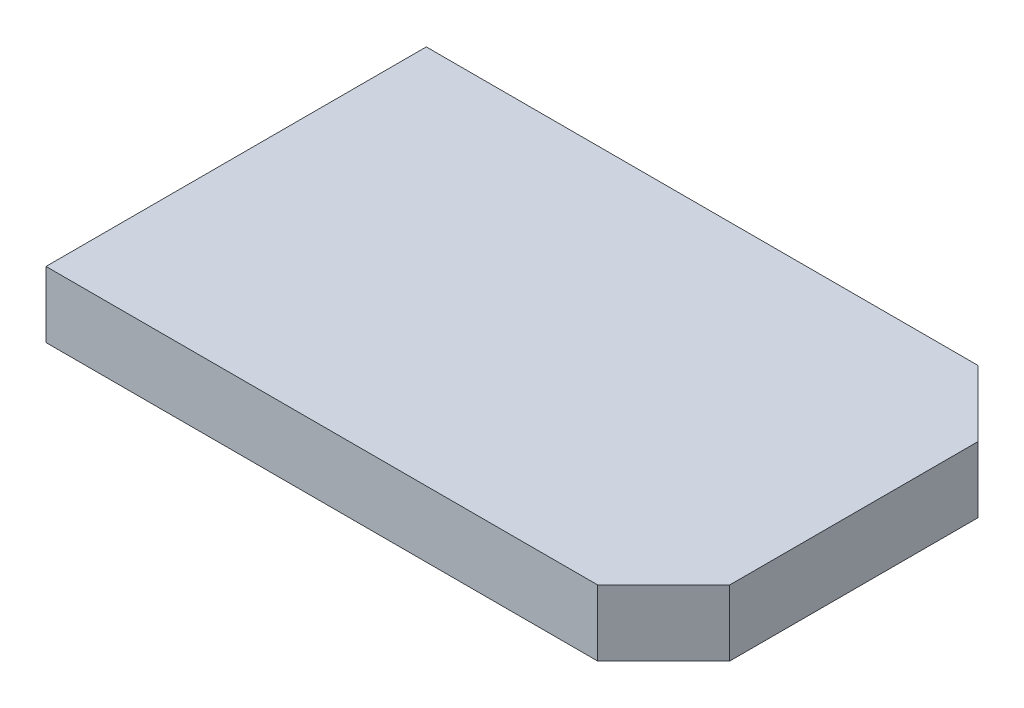
ISO-10303-21;
HEADER;
FILE_DESCRIPTION(('STEP AP214'),'2;1');
FILE_NAME('part.step','',(''),(''),'','','');
FILE_SCHEMA(('AUTOMOTIVE_DESIGN { 1 0 10303 214 1 1 1 1 }'));
ENDSEC;
DATA;
#1=APPLICATION_CONTEXT('core data for automotive mechanical design processes');
#2=APPLICATION_PROTOCOL_DEFINITION('international standard','automotive_design',2000,#1);
#3=PRODUCT_CONTEXT('',#1,'mechanical');
#4=PRODUCT('Part','Part','',(#3));
#5=PRODUCT_RELATED_PRODUCT_CATEGORY('part','',(#4));
#6=PRODUCT_DEFINITION_FORMATION('','',#4);
#7=PRODUCT_DEFINITION_CONTEXT('part definition',#1,'design');
#8=PRODUCT_DEFINITION('design','',#6,#7);
#9=PRODUCT_DEFINITION_SHAPE('','',#8);
#10=(LENGTH_UNIT() NAMED_UNIT(*) SI_UNIT(.MILLI.,.METRE.));
#11=(NAMED_UNIT(*) PLANE_ANGLE_UNIT() SI_UNIT($,.RADIAN.));
#12=(NAMED_UNIT(*) SI_UNIT($,.STERADIAN.) SOLID_ANGLE_UNIT());
#13=UNCERTAINTY_MEASURE_WITH_UNIT(LENGTH_MEASURE(1.E-05),#10,'distance_accuracy_value','');
#14=(GEOMETRIC_REPRESENTATION_CONTEXT(3) GLOBAL_UNCERTAINTY_ASSIGNED_CONTEXT((#13)) GLOBAL_UNIT_ASSIGNED_CONTEXT((#10,
#11,#12)) REPRESENTATION_CONTEXT('',''));
#15=CARTESIAN_POINT('',(0.,0.,0.));
#16=DIRECTION('',(0.,0.,1.));
#17=DIRECTION('',(1.,0.,0.));
#18=AXIS2_PLACEMENT_3D('',#15,#16,#17);
#19=CARTESIAN_POINT('',(56.1921288492615,12.,-34.5944364420798));
#20=DIRECTION('',(-1.,0.,0.));
#21=DIRECTION('',(0.,0.,1.));
#22=AXIS2_PLACEMENT_3D('',#19,#20,#21);
#23=PLANE('',#22);
#24=DIRECTION('',(0.,0.,-1.));
#25=VECTOR('',#24,1.);
#26=CARTESIAN_POINT('',(56.1921288492615,0.,-34.5944364420798));
#27=LINE('',#26,#25);
#28=CARTESIAN_POINT('',(56.1921288492615,0.,22.5944364420798));
#29=VERTEX_POINT('',#28);
#30=CARTESIAN_POINT('',(56.1921288492615,0.,-22.5944364420797));
#31=VERTEX_POINT('',#30);
#32=EDGE_CURVE('E115',#29,#31,#27,.T.);
#33=ORIENTED_EDGE('',*,*,#32,.T.);
#34=DIRECTION('',(0.,1.,0.));
#35=VECTOR('',#34,1.);
#36=CARTESIAN_POINT('',(56.1921288492615,12.,-22.5944364420797));
#37=LINE('',#36,#35);
#38=CARTESIAN_POINT('',(56.1921288492615,12.,-22.5944364420797));
#39=VERTEX_POINT('',#38);
#40=EDGE_CURVE('E41',#31,#39,#37,.T.);
#41=ORIENTED_EDGE('',*,*,#40,.T.);
#42=DIRECTION('',(0.,0.,-1.));
#43=VECTOR('',#42,1.);
#44=CARTESIAN_POINT('',(56.1921288492615,12.,-34.5944364420798));
#45=LINE('',#44,#43);
#46=CARTESIAN_POINT('',(56.1921288492615,12.,22.5944364420798));
#47=VERTEX_POINT('',#46);
#48=EDGE_CURVE('E96',#47,#39,#45,.T.);
#49=ORIENTED_EDGE('',*,*,#48,.F.);
#50=DIRECTION('',(0.,-1.,0.));
#51=VECTOR('',#50,1.);
#52=CARTESIAN_POINT('',(56.1921288492615,12.,22.5944364420798));
#53=LINE('',#52,#51);
#54=EDGE_CURVE('E104',#47,#29,#53,.T.);
#55=ORIENTED_EDGE('',*,*,#54,.T.);
#56=EDGE_LOOP('',(#33,#41,#49,#55));
#57=FACE_BOUND('',#56,.T.);
#58=ADVANCED_FACE('F33',(#57),#23,.F.);
#59=CARTESIAN_POINT('',(-56.1921288492615,12.,-34.5944364420798));
#60=DIRECTION('',(0.,0.,1.));
#61=DIRECTION('',(1.,0.,0.));
#62=AXIS2_PLACEMENT_3D('',#59,#60,#61);
#63=PLANE('',#62);
#64=DIRECTION('',(-1.,0.,0.));
#65=VECTOR('',#64,1.);
#66=CARTESIAN_POINT('',(-56.1921288492615,12.,-34.5944364420798));
#67=LINE('',#66,#65);
#68=CARTESIAN_POINT('',(44.1921288492614,12.,-34.5944364420798));
#69=VERTEX_POINT('',#68);
#70=CARTESIAN_POINT('',(-56.1921288492615,12.,-34.5944364420798));
#71=VERTEX_POINT('',#70);
#72=EDGE_CURVE('E85',#69,#71,#67,.T.);
#73=ORIENTED_EDGE('',*,*,#72,.F.);
#74=DIRECTION('',(0.,-1.,0.));
#75=VECTOR('',#74,1.);
#76=CARTESIAN_POINT('',(44.1921288492614,12.,-34.5944364420798));
#77=LINE('',#76,#75);
#78=CARTESIAN_POINT('',(44.1921288492614,0.,-34.5944364420798));
#79=VERTEX_POINT('',#78);
#80=EDGE_CURVE('E132',#69,#79,#77,.T.);
#81=ORIENTED_EDGE('',*,*,#80,.T.);
#82=DIRECTION('',(-1.,0.,0.));
#83=VECTOR('',#82,1.);
#84=CARTESIAN_POINT('',(-56.1921288492615,0.,-34.5944364420798));
#85=LINE('',#84,#83);
#86=CARTESIAN_POINT('',(-56.1921288492615,0.,-34.5944364420798));
#87=VERTEX_POINT('',#86);
#88=EDGE_CURVE('E101',#79,#87,#85,.T.);
#89=ORIENTED_EDGE('',*,*,#88,.T.);
#90=DIRECTION('',(0.,-1.,0.));
#91=VECTOR('',#90,1.);
#92=CARTESIAN_POINT('',(-56.1921288492615,12.,-34.5944364420798));
#93=LINE('',#92,#91);
#94=EDGE_CURVE('E99',#71,#87,#93,.T.);
#95=ORIENTED_EDGE('',*,*,#94,.F.);
#96=EDGE_LOOP('',(#73,#81,#89,#95));
#97=FACE_BOUND('',#96,.T.);
#98=ADVANCED_FACE('F100',(#97),#63,.F.);
#99=CARTESIAN_POINT('',(-56.1921288492615,12.,-34.5944364420798));
#100=DIRECTION('',(1.,0.,0.));
#101=DIRECTION('',(0.,0.,-1.));
#102=AXIS2_PLACEMENT_3D('',#99,#100,#101);
#103=PLANE('',#102);
#104=DIRECTION('',(0.,0.,1.));
#105=VECTOR('',#104,1.);
#106=CARTESIAN_POINT('',(-56.1921288492615,0.,-34.5944364420798));
#107=LINE('',#106,#105);
#108=CARTESIAN_POINT('',(-56.1921288492615,0.,34.5944364420798));
#109=VERTEX_POINT('',#108);
#110=EDGE_CURVE('E118',#87,#109,#107,.T.);
#111=ORIENTED_EDGE('',*,*,#110,.T.);
#112=DIRECTION('',(0.,-1.,0.));
#113=VECTOR('',#112,1.);
#114=CARTESIAN_POINT('',(-56.1921288492615,12.,34.5944364420798));
#115=LINE('',#114,#113);
#116=CARTESIAN_POINT('',(-56.1921288492615,12.,34.5944364420798));
#117=VERTEX_POINT('',#116);
#118=EDGE_CURVE('E105',#117,#109,#115,.T.);
#119=ORIENTED_EDGE('',*,*,#118,.F.);
#120=DIRECTION('',(0.,0.,1.));
#121=VECTOR('',#120,1.);
#122=CARTESIAN_POINT('',(-56.1921288492615,12.,-34.5944364420798));
#123=LINE('',#122,#121);
#124=EDGE_CURVE('E90',#71,#117,#123,.T.);
#125=ORIENTED_EDGE('',*,*,#124,.F.);
#126=ORIENTED_EDGE('',*,*,#94,.T.);
#127=EDGE_LOOP('',(#111,#119,#125,#126));
#128=FACE_BOUND('',#127,.T.);
#129=ADVANCED_FACE('F107',(#128),#103,.F.);
#130=CARTESIAN_POINT('',(-56.1921288492615,12.,34.5944364420798));
#131=DIRECTION('',(0.,0.,-1.));
#132=DIRECTION('',(-1.,0.,0.));
#133=AXIS2_PLACEMENT_3D('',#130,#131,#132);
#134=PLANE('',#133);
#135=DIRECTION('',(1.,0.,0.));
#136=VECTOR('',#135,1.);
#137=CARTESIAN_POINT('',(-56.1921288492615,0.,34.5944364420798));
#138=LINE('',#137,#136);
#139=CARTESIAN_POINT('',(44.1921288492614,0.,34.5944364420798));
#140=VERTEX_POINT('',#139);
#141=EDGE_CURVE('E120',#109,#140,#138,.T.);
#142=ORIENTED_EDGE('',*,*,#141,.T.);
#143=DIRECTION('',(0.,1.,0.));
#144=VECTOR('',#143,1.);
#145=CARTESIAN_POINT('',(44.1921288492614,12.,34.5944364420798));
#146=LINE('',#145,#144);
#147=CARTESIAN_POINT('',(44.1921288492614,12.,34.5944364420798));
#148=VERTEX_POINT('',#147);
#149=EDGE_CURVE('E128',#140,#148,#146,.T.);
#150=ORIENTED_EDGE('',*,*,#149,.T.);
#151=DIRECTION('',(1.,0.,0.));
#152=VECTOR('',#151,1.);
#153=CARTESIAN_POINT('',(-56.1921288492615,12.,34.5944364420798));
#154=LINE('',#153,#152);
#155=EDGE_CURVE('E110',#117,#148,#154,.T.);
#156=ORIENTED_EDGE('',*,*,#155,.F.);
#157=ORIENTED_EDGE('',*,*,#118,.T.);
#158=EDGE_LOOP('',(#142,#150,#156,#157));
#159=FACE_BOUND('',#158,.T.);
#160=ADVANCED_FACE('F138',(#159),#134,.F.);
#161=CARTESIAN_POINT('',(0.,12.,0.));
#162=DIRECTION('',(0.,1.,0.));
#163=DIRECTION('',(0.,0.,1.));
#164=AXIS2_PLACEMENT_3D('',#161,#162,#163);
#165=PLANE('',#164);
#166=ORIENTED_EDGE('',*,*,#48,.T.);
#167=DIRECTION('',(0.707106781186546,0.,0.707106781186549));
#168=VECTOR('',#167,1.);
#169=CARTESIAN_POINT('',(39.3932826456707,12.,-39.3932826456705));
#170=LINE('',#169,#168);
#171=EDGE_CURVE('E11',#39,#69,#170,.F.);
#172=ORIENTED_EDGE('',*,*,#171,.T.);
#173=ORIENTED_EDGE('',*,*,#72,.T.);
#174=ORIENTED_EDGE('',*,*,#124,.T.);
#175=ORIENTED_EDGE('',*,*,#155,.T.);
#176=DIRECTION('',(-0.707106781186549,0.,0.707106781186546));
#177=VECTOR('',#176,1.);
#178=CARTESIAN_POINT('',(39.3932826456705,12.,39.3932826456707));
#179=LINE('',#178,#177);
#180=EDGE_CURVE('E130',#148,#47,#179,.F.);
#181=ORIENTED_EDGE('',*,*,#180,.T.);
#182=EDGE_LOOP('',(#166,#172,#173,#174,#175,#181));
#183=FACE_BOUND('',#182,.T.);
#184=ADVANCED_FACE('F87',(#183),#165,.T.);
#185=CARTESIAN_POINT('',(0.,0.,0.));
#186=DIRECTION('',(0.,1.,0.));
#187=DIRECTION('',(0.,0.,1.));
#188=AXIS2_PLACEMENT_3D('',#185,#186,#187);
#189=PLANE('',#188);
#190=ORIENTED_EDGE('',*,*,#88,.F.);
#191=DIRECTION('',(-0.707106781186546,0.,-0.707106781186549));
#192=VECTOR('',#191,1.);
#193=CARTESIAN_POINT('',(44.1921288492614,0.,-34.5944364420798));
#194=LINE('',#193,#192);
#195=EDGE_CURVE('E55',#79,#31,#194,.F.);
#196=ORIENTED_EDGE('',*,*,#195,.T.);
#197=ORIENTED_EDGE('',*,*,#32,.F.);
#198=DIRECTION('',(0.707106781186549,0.,-0.707106781186546));
#199=VECTOR('',#198,1.);
#200=CARTESIAN_POINT('',(56.1921288492615,0.,22.5944364420798));
#201=LINE('',#200,#199);
#202=EDGE_CURVE('E126',#29,#140,#201,.F.);
#203=ORIENTED_EDGE('',*,*,#202,.T.);
#204=ORIENTED_EDGE('',*,*,#141,.F.);
#205=ORIENTED_EDGE('',*,*,#110,.F.);
#206=EDGE_LOOP('',(#190,#196,#197,#203,#204,#205));
#207=FACE_BOUND('',#206,.T.);
#208=ADVANCED_FACE('F135',(#207),#189,.F.);
#209=CARTESIAN_POINT('',(56.1921288492615,12.,22.5944364420798));
#210=DIRECTION('',(-0.707106781186546,0.,-0.707106781186549));
#211=DIRECTION('',(0.,-1.,0.));
#212=AXIS2_PLACEMENT_3D('',#209,#210,#211);
#213=PLANE('',#212);
#214=ORIENTED_EDGE('',*,*,#180,.F.);
#215=ORIENTED_EDGE('',*,*,#149,.F.);
#216=ORIENTED_EDGE('',*,*,#202,.F.);
#217=ORIENTED_EDGE('',*,*,#54,.F.);
#218=EDGE_LOOP('',(#214,#215,#216,#217));
#219=FACE_BOUND('',#218,.T.);
#220=ADVANCED_FACE('F143',(#219),#213,.F.);
#221=CARTESIAN_POINT('',(44.1921288492614,12.,-34.5944364420798));
#222=DIRECTION('',(-0.707106781186549,0.,0.707106781186546));
#223=DIRECTION('',(0.,-1.,0.));
#224=AXIS2_PLACEMENT_3D('',#221,#222,#223);
#225=PLANE('',#224);
#226=ORIENTED_EDGE('',*,*,#171,.F.);
#227=ORIENTED_EDGE('',*,*,#40,.F.);
#228=ORIENTED_EDGE('',*,*,#195,.F.);
#229=ORIENTED_EDGE('',*,*,#80,.F.);
#230=EDGE_LOOP('',(#226,#227,#228,#229));
#231=FACE_BOUND('',#230,.T.);
#232=ADVANCED_FACE('F35',(#231),#225,.F.);
#233=CLOSED_SHELL('',(#58,#98,#129,#160,#184,#208,#220,#232));
#234=MANIFOLD_SOLID_BREP('B2',#233);
#235=ADVANCED_BREP_SHAPE_REPRESENTATION('',(#18,#234),#14);
#236=SHAPE_DEFINITION_REPRESENTATION(#9,#235);
ENDSEC;
END-ISO-10303-21;
